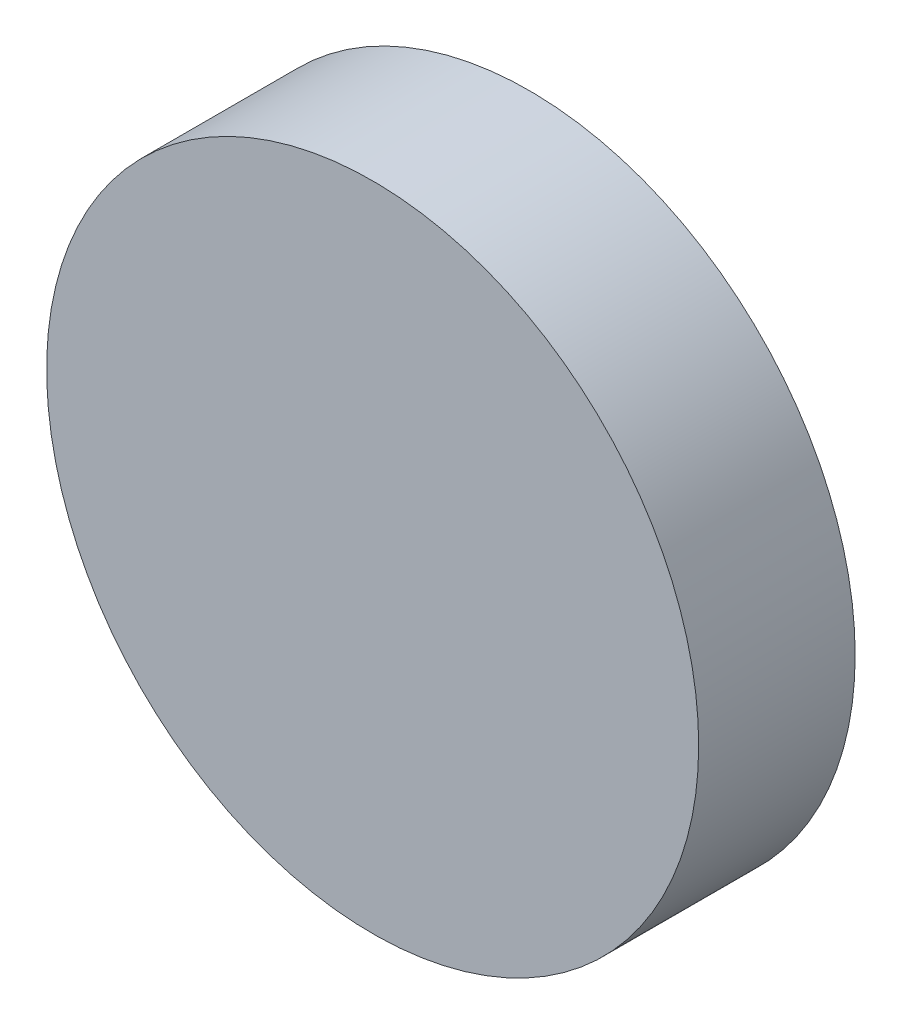
ISO-10303-21;
HEADER;
FILE_DESCRIPTION(('STEP AP214'),'2;1');
FILE_NAME('part.step','',(''),(''),'','','');
FILE_SCHEMA(('AUTOMOTIVE_DESIGN { 1 0 10303 214 1 1 1 1 }'));
ENDSEC;
DATA;
#1=APPLICATION_CONTEXT('core data for automotive mechanical design processes');
#2=APPLICATION_PROTOCOL_DEFINITION('international standard','automotive_design',2000,#1);
#3=PRODUCT_CONTEXT('',#1,'mechanical');
#4=PRODUCT('Part','Part','',(#3));
#5=PRODUCT_RELATED_PRODUCT_CATEGORY('part','',(#4));
#6=PRODUCT_DEFINITION_FORMATION('','',#4);
#7=PRODUCT_DEFINITION_CONTEXT('part definition',#1,'design');
#8=PRODUCT_DEFINITION('design','',#6,#7);
#9=PRODUCT_DEFINITION_SHAPE('','',#8);
#10=(LENGTH_UNIT() NAMED_UNIT(*) SI_UNIT(.MILLI.,.METRE.));
#11=(NAMED_UNIT(*) PLANE_ANGLE_UNIT() SI_UNIT($,.RADIAN.));
#12=(NAMED_UNIT(*) SI_UNIT($,.STERADIAN.) SOLID_ANGLE_UNIT());
#13=UNCERTAINTY_MEASURE_WITH_UNIT(LENGTH_MEASURE(1.E-05),#10,'distance_accuracy_value','');
#14=(GEOMETRIC_REPRESENTATION_CONTEXT(3) GLOBAL_UNCERTAINTY_ASSIGNED_CONTEXT((#13)) GLOBAL_UNIT_ASSIGNED_CONTEXT((#10,
#11,#12)) REPRESENTATION_CONTEXT('',''));
#15=CARTESIAN_POINT('',(0.,0.,0.));
#16=DIRECTION('',(0.,0.,1.));
#17=DIRECTION('',(1.,0.,0.));
#18=AXIS2_PLACEMENT_3D('',#15,#16,#17);
#19=CARTESIAN_POINT('',(0.,0.,6.));
#20=DIRECTION('',(0.,0.,-1.));
#21=DIRECTION('',(-1.,0.,0.));
#22=AXIS2_PLACEMENT_3D('',#19,#20,#21);
#23=CYLINDRICAL_SURFACE('',#22,12.5);
#24=CARTESIAN_POINT('',(0.,0.,6.));
#25=DIRECTION('',(0.,0.,1.));
#26=DIRECTION('',(1.,0.,0.));
#27=AXIS2_PLACEMENT_3D('',#24,#25,#26);
#28=CIRCLE('',#27,12.5);
#29=CARTESIAN_POINT('',(12.5,0.,6.));
#30=VERTEX_POINT('',#29);
#31=EDGE_CURVE('E10',#30,#30,#28,.T.);
#32=ORIENTED_EDGE('',*,*,#31,.F.);
#33=EDGE_LOOP('',(#32));
#34=FACE_BOUND('',#33,.T.);
#35=CARTESIAN_POINT('',(0.,0.,0.));
#36=DIRECTION('',(0.,0.,1.));
#37=DIRECTION('',(1.,0.,0.));
#38=AXIS2_PLACEMENT_3D('',#35,#36,#37);
#39=CIRCLE('',#38,12.5);
#40=CARTESIAN_POINT('',(12.5,0.,0.));
#41=VERTEX_POINT('',#40);
#42=EDGE_CURVE('E42',#41,#41,#39,.T.);
#43=ORIENTED_EDGE('',*,*,#42,.T.);
#44=EDGE_LOOP('',(#43));
#45=FACE_BOUND('',#44,.T.);
#46=ADVANCED_FACE('F39',(#34,#45),#23,.T.);
#47=CARTESIAN_POINT('',(0.,0.,6.));
#48=DIRECTION('',(0.,0.,1.));
#49=DIRECTION('',(1.,0.,0.));
#50=AXIS2_PLACEMENT_3D('',#47,#48,#49);
#51=PLANE('',#50);
#52=ORIENTED_EDGE('',*,*,#31,.T.);
#53=EDGE_LOOP('',(#52));
#54=FACE_BOUND('',#53,.T.);
#55=ADVANCED_FACE('F56',(#54),#51,.T.);
#56=CARTESIAN_POINT('',(0.,0.,0.));
#57=DIRECTION('',(0.,0.,1.));
#58=DIRECTION('',(1.,0.,0.));
#59=AXIS2_PLACEMENT_3D('',#56,#57,#58);
#60=PLANE('',#59);
#61=ORIENTED_EDGE('',*,*,#42,.F.);
#62=EDGE_LOOP('',(#61));
#63=FACE_BOUND('',#62,.T.);
#64=ADVANCED_FACE('F54',(#63),#60,.F.);
#65=CLOSED_SHELL('',(#46,#55,#64));
#66=MANIFOLD_SOLID_BREP('B2',#65);
#67=ADVANCED_BREP_SHAPE_REPRESENTATION('',(#18,#66),#14);
#68=SHAPE_DEFINITION_REPRESENTATION(#9,#67);
ENDSEC;
END-ISO-10303-21;
